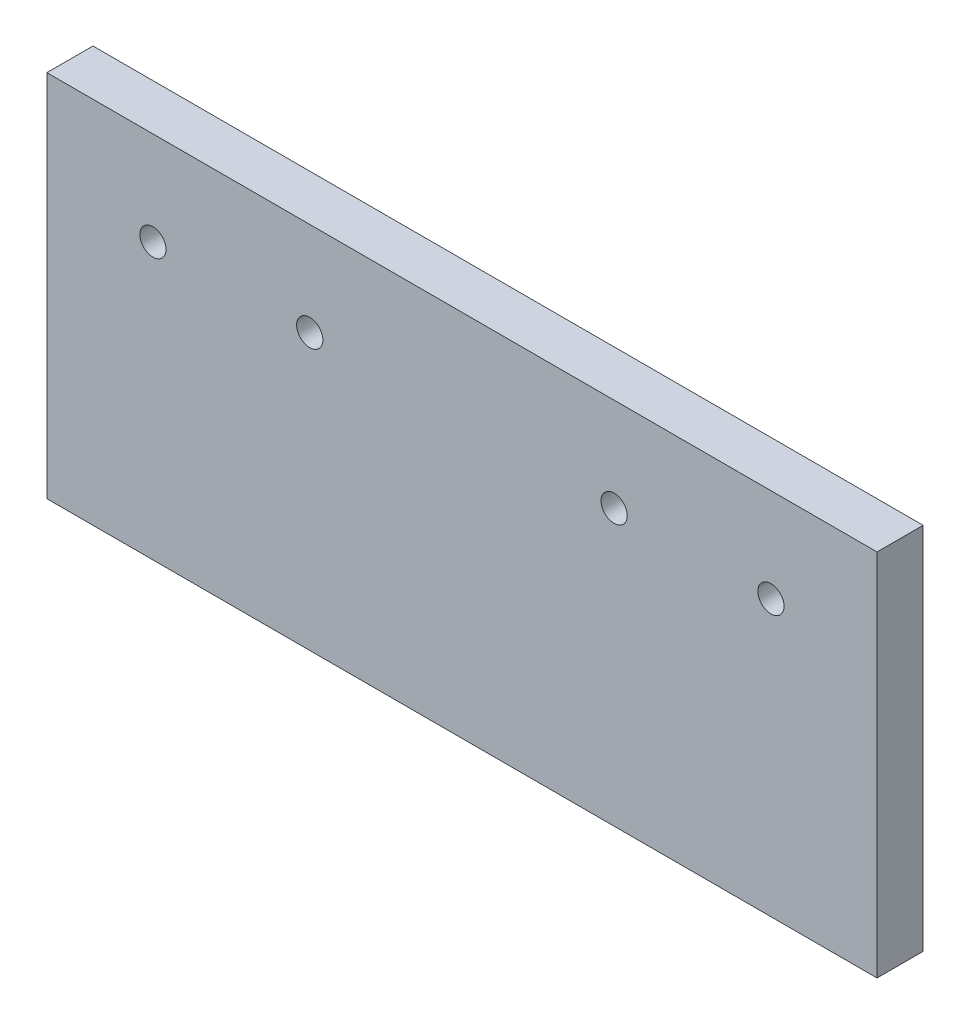
ISO-10303-21;
HEADER;
FILE_DESCRIPTION(('STEP AP214'),'2;1');
FILE_NAME('part.step','',(''),(''),'','','');
FILE_SCHEMA(('AUTOMOTIVE_DESIGN { 1 0 10303 214 1 1 1 1 }'));
ENDSEC;
DATA;
#1=APPLICATION_CONTEXT('core data for automotive mechanical design processes');
#2=APPLICATION_PROTOCOL_DEFINITION('international standard','automotive_design',2000,#1);
#3=PRODUCT_CONTEXT('',#1,'mechanical');
#4=PRODUCT('Part','Part','',(#3));
#5=PRODUCT_RELATED_PRODUCT_CATEGORY('part','',(#4));
#6=PRODUCT_DEFINITION_FORMATION('','',#4);
#7=PRODUCT_DEFINITION_CONTEXT('part definition',#1,'design');
#8=PRODUCT_DEFINITION('design','',#6,#7);
#9=PRODUCT_DEFINITION_SHAPE('','',#8);
#10=(LENGTH_UNIT() NAMED_UNIT(*) SI_UNIT(.MILLI.,.METRE.));
#11=(NAMED_UNIT(*) PLANE_ANGLE_UNIT() SI_UNIT($,.RADIAN.));
#12=(NAMED_UNIT(*) SI_UNIT($,.STERADIAN.) SOLID_ANGLE_UNIT());
#13=UNCERTAINTY_MEASURE_WITH_UNIT(LENGTH_MEASURE(1.E-05),#10,'distance_accuracy_value','');
#14=(GEOMETRIC_REPRESENTATION_CONTEXT(3) GLOBAL_UNCERTAINTY_ASSIGNED_CONTEXT((#13)) GLOBAL_UNIT_ASSIGNED_CONTEXT((#10,
#11,#12)) REPRESENTATION_CONTEXT('',''));
#15=CARTESIAN_POINT('',(0.,0.,0.));
#16=DIRECTION('',(0.,0.,1.));
#17=DIRECTION('',(1.,0.,0.));
#18=AXIS2_PLACEMENT_3D('',#15,#16,#17);
#19=CARTESIAN_POINT('',(19.215822371246,-29.8540912075977,-5.));
#20=DIRECTION('',(-1.,0.,0.));
#21=DIRECTION('',(0.,0.,1.));
#22=AXIS2_PLACEMENT_3D('',#19,#20,#21);
#23=PLANE('',#22);
#24=DIRECTION('',(0.,-1.,0.));
#25=VECTOR('',#24,1.);
#26=CARTESIAN_POINT('',(19.215822371246,-29.8540912075977,0.));
#27=LINE('',#26,#25);
#28=CARTESIAN_POINT('',(19.215822371246,10.1459087924023,0.));
#29=VERTEX_POINT('',#28);
#30=CARTESIAN_POINT('',(19.215822371246,-29.8540912075977,0.));
#31=VERTEX_POINT('',#30);
#32=EDGE_CURVE('E102',#29,#31,#27,.T.);
#33=ORIENTED_EDGE('',*,*,#32,.T.);
#34=DIRECTION('',(0.,0.,1.));
#35=VECTOR('',#34,1.);
#36=CARTESIAN_POINT('',(19.215822371246,-29.8540912075977,-5.));
#37=LINE('',#36,#35);
#38=CARTESIAN_POINT('',(19.215822371246,-29.8540912075977,-5.));
#39=VERTEX_POINT('',#38);
#40=EDGE_CURVE('E11',#39,#31,#37,.T.);
#41=ORIENTED_EDGE('',*,*,#40,.F.);
#42=DIRECTION('',(0.,-1.,0.));
#43=VECTOR('',#42,1.);
#44=CARTESIAN_POINT('',(19.215822371246,-29.8540912075977,-5.));
#45=LINE('',#44,#43);
#46=CARTESIAN_POINT('',(19.215822371246,10.1459087924023,-5.));
#47=VERTEX_POINT('',#46);
#48=EDGE_CURVE('E89',#47,#39,#45,.T.);
#49=ORIENTED_EDGE('',*,*,#48,.F.);
#50=DIRECTION('',(0.,0.,1.));
#51=VECTOR('',#50,1.);
#52=CARTESIAN_POINT('',(19.215822371246,10.1459087924023,-5.));
#53=LINE('',#52,#51);
#54=EDGE_CURVE('E98',#47,#29,#53,.T.);
#55=ORIENTED_EDGE('',*,*,#54,.T.);
#56=EDGE_LOOP('',(#33,#41,#49,#55));
#57=FACE_BOUND('',#56,.T.);
#58=ADVANCED_FACE('F36',(#57),#23,.F.);
#59=CARTESIAN_POINT('',(19.215822371246,-29.8540912075977,-5.));
#60=DIRECTION('',(0.,1.,0.));
#61=DIRECTION('',(0.,0.,1.));
#62=AXIS2_PLACEMENT_3D('',#59,#60,#61);
#63=PLANE('',#62);
#64=DIRECTION('',(-1.,0.,0.));
#65=VECTOR('',#64,1.);
#66=CARTESIAN_POINT('',(19.215822371246,-29.8540912075977,0.));
#67=LINE('',#66,#65);
#68=CARTESIAN_POINT('',(-70.784177628754,-29.8540912075977,0.));
#69=VERTEX_POINT('',#68);
#70=EDGE_CURVE('E93',#31,#69,#67,.T.);
#71=ORIENTED_EDGE('',*,*,#70,.T.);
#72=DIRECTION('',(0.,0.,1.));
#73=VECTOR('',#72,1.);
#74=CARTESIAN_POINT('',(-70.784177628754,-29.8540912075977,-5.));
#75=LINE('',#74,#73);
#76=CARTESIAN_POINT('',(-70.784177628754,-29.8540912075977,-5.));
#77=VERTEX_POINT('',#76);
#78=EDGE_CURVE('E45',#77,#69,#75,.T.);
#79=ORIENTED_EDGE('',*,*,#78,.F.);
#80=DIRECTION('',(-1.,0.,0.));
#81=VECTOR('',#80,1.);
#82=CARTESIAN_POINT('',(19.215822371246,-29.8540912075977,-5.));
#83=LINE('',#82,#81);
#84=EDGE_CURVE('E84',#39,#77,#83,.T.);
#85=ORIENTED_EDGE('',*,*,#84,.F.);
#86=ORIENTED_EDGE('',*,*,#40,.T.);
#87=EDGE_LOOP('',(#71,#79,#85,#86));
#88=FACE_BOUND('',#87,.T.);
#89=ADVANCED_FACE('F92',(#88),#63,.F.);
#90=CARTESIAN_POINT('',(-70.784177628754,-29.8540912075977,-5.));
#91=DIRECTION('',(1.,0.,0.));
#92=DIRECTION('',(0.,0.,-1.));
#93=AXIS2_PLACEMENT_3D('',#90,#91,#92);
#94=PLANE('',#93);
#95=DIRECTION('',(0.,1.,0.));
#96=VECTOR('',#95,1.);
#97=CARTESIAN_POINT('',(-70.784177628754,-29.8540912075977,0.));
#98=LINE('',#97,#96);
#99=CARTESIAN_POINT('',(-70.784177628754,10.1459087924023,0.));
#100=VERTEX_POINT('',#99);
#101=EDGE_CURVE('E71',#69,#100,#98,.T.);
#102=ORIENTED_EDGE('',*,*,#101,.T.);
#103=DIRECTION('',(0.,0.,1.));
#104=VECTOR('',#103,1.);
#105=CARTESIAN_POINT('',(-70.784177628754,10.1459087924023,-5.));
#106=LINE('',#105,#104);
#107=CARTESIAN_POINT('',(-70.784177628754,10.1459087924023,-5.));
#108=VERTEX_POINT('',#107);
#109=EDGE_CURVE('E94',#108,#100,#106,.T.);
#110=ORIENTED_EDGE('',*,*,#109,.F.);
#111=DIRECTION('',(0.,1.,0.));
#112=VECTOR('',#111,1.);
#113=CARTESIAN_POINT('',(-70.784177628754,-29.8540912075977,-5.));
#114=LINE('',#113,#112);
#115=EDGE_CURVE('E87',#77,#108,#114,.T.);
#116=ORIENTED_EDGE('',*,*,#115,.F.);
#117=ORIENTED_EDGE('',*,*,#78,.T.);
#118=EDGE_LOOP('',(#102,#110,#116,#117));
#119=FACE_BOUND('',#118,.T.);
#120=ADVANCED_FACE('F96',(#119),#94,.F.);
#121=CARTESIAN_POINT('',(19.215822371246,10.1459087924023,-5.));
#122=DIRECTION('',(0.,-1.,0.));
#123=DIRECTION('',(0.,0.,-1.));
#124=AXIS2_PLACEMENT_3D('',#121,#122,#123);
#125=PLANE('',#124);
#126=DIRECTION('',(1.,0.,0.));
#127=VECTOR('',#126,1.);
#128=CARTESIAN_POINT('',(19.215822371246,10.1459087924023,0.));
#129=LINE('',#128,#127);
#130=EDGE_CURVE('E77',#100,#29,#129,.T.);
#131=ORIENTED_EDGE('',*,*,#130,.T.);
#132=ORIENTED_EDGE('',*,*,#54,.F.);
#133=DIRECTION('',(1.,0.,0.));
#134=VECTOR('',#133,1.);
#135=CARTESIAN_POINT('',(19.215822371246,10.1459087924023,-5.));
#136=LINE('',#135,#134);
#137=EDGE_CURVE('E54',#108,#47,#136,.T.);
#138=ORIENTED_EDGE('',*,*,#137,.F.);
#139=ORIENTED_EDGE('',*,*,#109,.T.);
#140=EDGE_LOOP('',(#131,#132,#138,#139));
#141=FACE_BOUND('',#140,.T.);
#142=ADVANCED_FACE('F161',(#141),#125,.F.);
#143=CARTESIAN_POINT('',(0.,0.,-5.));
#144=DIRECTION('',(0.,0.,1.));
#145=DIRECTION('',(1.,0.,0.));
#146=AXIS2_PLACEMENT_3D('',#143,#144,#145);
#147=PLANE('',#146);
#148=CARTESIAN_POINT('',(-9.28417762875402,0.,-5.));
#149=DIRECTION('',(0.,0.,1.));
#150=DIRECTION('',(1.,0.,0.));
#151=AXIS2_PLACEMENT_3D('',#148,#149,#150);
#152=CIRCLE('',#151,1.42240000000001);
#153=CARTESIAN_POINT('',(-7.86177762875401,0.,-5.));
#154=VERTEX_POINT('',#153);
#155=EDGE_CURVE('E118',#154,#154,#152,.T.);
#156=ORIENTED_EDGE('',*,*,#155,.T.);
#157=EDGE_LOOP('',(#156));
#158=FACE_BOUND('',#157,.T.);
#159=CARTESIAN_POINT('',(7.71582237124599,0.,-5.));
#160=DIRECTION('',(0.,0.,1.));
#161=DIRECTION('',(1.,0.,0.));
#162=AXIS2_PLACEMENT_3D('',#159,#160,#161);
#163=CIRCLE('',#162,1.42240000000001);
#164=CARTESIAN_POINT('',(9.13822237124599,0.,-5.));
#165=VERTEX_POINT('',#164);
#166=EDGE_CURVE('E124',#165,#165,#163,.T.);
#167=ORIENTED_EDGE('',*,*,#166,.T.);
#168=EDGE_LOOP('',(#167));
#169=FACE_BOUND('',#168,.T.);
#170=CARTESIAN_POINT('',(-59.284177628754,0.,-5.));
#171=DIRECTION('',(0.,0.,1.));
#172=DIRECTION('',(1.,0.,0.));
#173=AXIS2_PLACEMENT_3D('',#170,#171,#172);
#174=CIRCLE('',#173,1.42239999999999);
#175=CARTESIAN_POINT('',(-57.861777628754,0.,-5.));
#176=VERTEX_POINT('',#175);
#177=EDGE_CURVE('E114',#176,#176,#174,.T.);
#178=ORIENTED_EDGE('',*,*,#177,.T.);
#179=EDGE_LOOP('',(#178));
#180=FACE_BOUND('',#179,.T.);
#181=CARTESIAN_POINT('',(-42.284177628754,0.,-5.));
#182=DIRECTION('',(0.,0.,1.));
#183=DIRECTION('',(1.,0.,0.));
#184=AXIS2_PLACEMENT_3D('',#181,#182,#183);
#185=CIRCLE('',#184,1.42239999999999);
#186=CARTESIAN_POINT('',(-40.861777628754,0.,-5.));
#187=VERTEX_POINT('',#186);
#188=EDGE_CURVE('E122',#187,#187,#185,.T.);
#189=ORIENTED_EDGE('',*,*,#188,.T.);
#190=EDGE_LOOP('',(#189));
#191=FACE_BOUND('',#190,.T.);
#192=ORIENTED_EDGE('',*,*,#48,.T.);
#193=ORIENTED_EDGE('',*,*,#84,.T.);
#194=ORIENTED_EDGE('',*,*,#115,.T.);
#195=ORIENTED_EDGE('',*,*,#137,.T.);
#196=EDGE_LOOP('',(#192,#193,#194,#195));
#197=FACE_BOUND('',#196,.T.);
#198=ADVANCED_FACE('F85',(#158,#169,#180,#191,#197),#147,.F.);
#199=CARTESIAN_POINT('',(0.,0.,0.));
#200=DIRECTION('',(0.,0.,1.));
#201=DIRECTION('',(1.,0.,0.));
#202=AXIS2_PLACEMENT_3D('',#199,#200,#201);
#203=PLANE('',#202);
#204=CARTESIAN_POINT('',(-9.28417762875402,0.,0.));
#205=DIRECTION('',(0.,0.,1.));
#206=DIRECTION('',(1.,0.,0.));
#207=AXIS2_PLACEMENT_3D('',#204,#205,#206);
#208=CIRCLE('',#207,1.42240000000001);
#209=CARTESIAN_POINT('',(-7.86177762875401,0.,0.));
#210=VERTEX_POINT('',#209);
#211=EDGE_CURVE('E39',#210,#210,#208,.F.);
#212=ORIENTED_EDGE('',*,*,#211,.T.);
#213=EDGE_LOOP('',(#212));
#214=FACE_BOUND('',#213,.T.);
#215=CARTESIAN_POINT('',(7.71582237124599,0.,0.));
#216=DIRECTION('',(0.,0.,1.));
#217=DIRECTION('',(1.,0.,0.));
#218=AXIS2_PLACEMENT_3D('',#215,#216,#217);
#219=CIRCLE('',#218,1.42240000000001);
#220=CARTESIAN_POINT('',(9.13822237124599,0.,0.));
#221=VERTEX_POINT('',#220);
#222=EDGE_CURVE('E116',#221,#221,#219,.F.);
#223=ORIENTED_EDGE('',*,*,#222,.T.);
#224=EDGE_LOOP('',(#223));
#225=FACE_BOUND('',#224,.T.);
#226=CARTESIAN_POINT('',(-59.284177628754,0.,0.));
#227=DIRECTION('',(0.,0.,1.));
#228=DIRECTION('',(1.,0.,0.));
#229=AXIS2_PLACEMENT_3D('',#226,#227,#228);
#230=CIRCLE('',#229,1.42239999999999);
#231=CARTESIAN_POINT('',(-57.861777628754,0.,0.));
#232=VERTEX_POINT('',#231);
#233=EDGE_CURVE('E105',#232,#232,#230,.F.);
#234=ORIENTED_EDGE('',*,*,#233,.T.);
#235=EDGE_LOOP('',(#234));
#236=FACE_BOUND('',#235,.T.);
#237=CARTESIAN_POINT('',(-42.284177628754,0.,0.));
#238=DIRECTION('',(0.,0.,1.));
#239=DIRECTION('',(1.,0.,0.));
#240=AXIS2_PLACEMENT_3D('',#237,#238,#239);
#241=CIRCLE('',#240,1.42239999999999);
#242=CARTESIAN_POINT('',(-40.861777628754,0.,0.));
#243=VERTEX_POINT('',#242);
#244=EDGE_CURVE('E111',#243,#243,#241,.F.);
#245=ORIENTED_EDGE('',*,*,#244,.T.);
#246=EDGE_LOOP('',(#245));
#247=FACE_BOUND('',#246,.T.);
#248=ORIENTED_EDGE('',*,*,#32,.F.);
#249=ORIENTED_EDGE('',*,*,#130,.F.);
#250=ORIENTED_EDGE('',*,*,#101,.F.);
#251=ORIENTED_EDGE('',*,*,#70,.F.);
#252=EDGE_LOOP('',(#248,#249,#250,#251));
#253=FACE_BOUND('',#252,.T.);
#254=ADVANCED_FACE('F140',(#214,#225,#236,#247,#253),#203,.T.);
#255=CARTESIAN_POINT('',(-42.284177628754,0.,5.));
#256=DIRECTION('',(0.,0.,-1.));
#257=DIRECTION('',(-1.,0.,0.));
#258=AXIS2_PLACEMENT_3D('',#255,#256,#257);
#259=CYLINDRICAL_SURFACE('',#258,1.42239999999999);
#260=ORIENTED_EDGE('',*,*,#244,.F.);
#261=EDGE_LOOP('',(#260));
#262=FACE_BOUND('',#261,.T.);
#263=ORIENTED_EDGE('',*,*,#188,.F.);
#264=EDGE_LOOP('',(#263));
#265=FACE_BOUND('',#264,.T.);
#266=ADVANCED_FACE('F137',(#262,#265),#259,.F.);
#267=CARTESIAN_POINT('',(-59.284177628754,0.,5.));
#268=DIRECTION('',(0.,0.,-1.));
#269=DIRECTION('',(-1.,0.,0.));
#270=AXIS2_PLACEMENT_3D('',#267,#268,#269);
#271=CYLINDRICAL_SURFACE('',#270,1.42239999999999);
#272=ORIENTED_EDGE('',*,*,#233,.F.);
#273=EDGE_LOOP('',(#272));
#274=FACE_BOUND('',#273,.T.);
#275=ORIENTED_EDGE('',*,*,#177,.F.);
#276=EDGE_LOOP('',(#275));
#277=FACE_BOUND('',#276,.T.);
#278=ADVANCED_FACE('F139',(#274,#277),#271,.F.);
#279=CARTESIAN_POINT('',(7.71582237124599,0.,5.));
#280=DIRECTION('',(0.,0.,-1.));
#281=DIRECTION('',(-1.,0.,0.));
#282=AXIS2_PLACEMENT_3D('',#279,#280,#281);
#283=CYLINDRICAL_SURFACE('',#282,1.42240000000001);
#284=ORIENTED_EDGE('',*,*,#222,.F.);
#285=EDGE_LOOP('',(#284));
#286=FACE_BOUND('',#285,.T.);
#287=ORIENTED_EDGE('',*,*,#166,.F.);
#288=EDGE_LOOP('',(#287));
#289=FACE_BOUND('',#288,.T.);
#290=ADVANCED_FACE('F147',(#286,#289),#283,.F.);
#291=CARTESIAN_POINT('',(-9.28417762875402,0.,5.));
#292=DIRECTION('',(0.,0.,-1.));
#293=DIRECTION('',(-1.,0.,0.));
#294=AXIS2_PLACEMENT_3D('',#291,#292,#293);
#295=CYLINDRICAL_SURFACE('',#294,1.42240000000001);
#296=ORIENTED_EDGE('',*,*,#211,.F.);
#297=EDGE_LOOP('',(#296));
#298=FACE_BOUND('',#297,.T.);
#299=ORIENTED_EDGE('',*,*,#155,.F.);
#300=EDGE_LOOP('',(#299));
#301=FACE_BOUND('',#300,.T.);
#302=ADVANCED_FACE('F209',(#298,#301),#295,.F.);
#303=CLOSED_SHELL('',(#58,#89,#120,#142,#198,#254,#266,#278,#290,#302));
#304=MANIFOLD_SOLID_BREP('B2',#303);
#305=ADVANCED_BREP_SHAPE_REPRESENTATION('',(#18,#304),#14);
#306=SHAPE_DEFINITION_REPRESENTATION(#9,#305);
ENDSEC;
END-ISO-10303-21;
